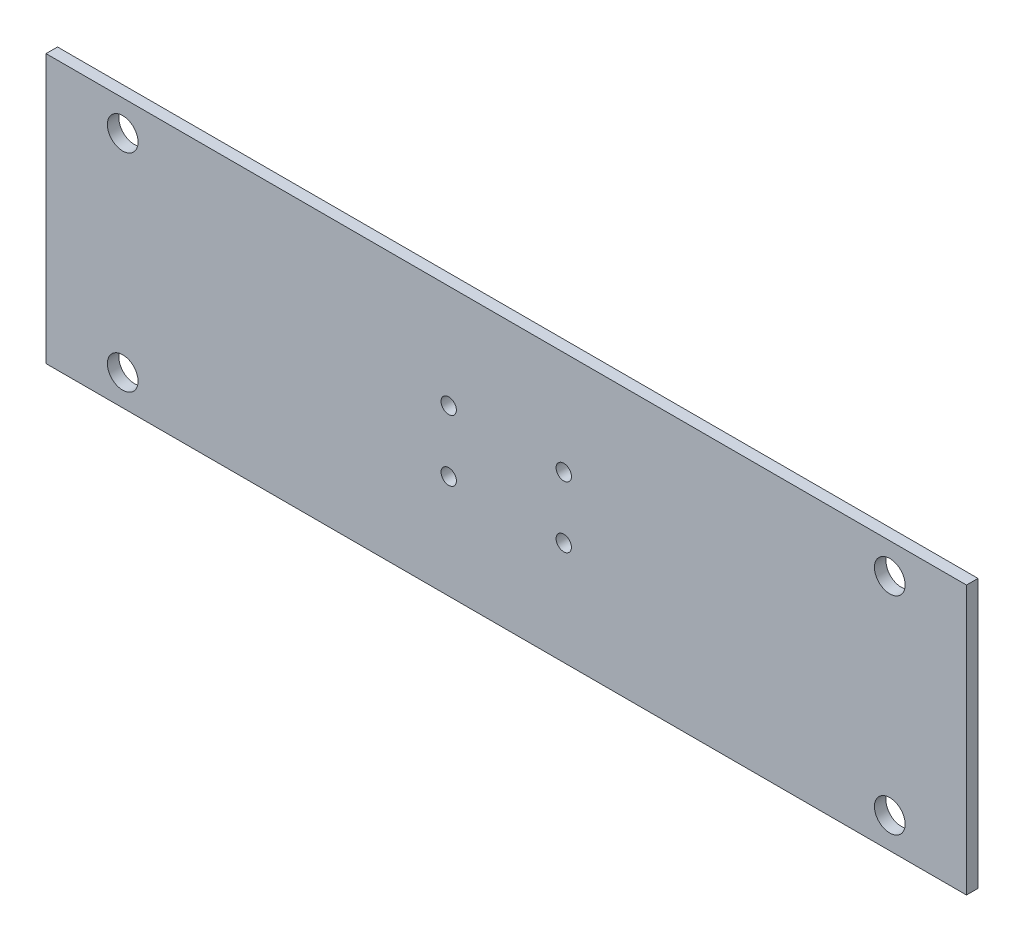
ISO-10303-21;
HEADER;
FILE_DESCRIPTION(('STEP AP214'),'2;1');
FILE_NAME('part.step','',(''),(''),'','','');
FILE_SCHEMA(('AUTOMOTIVE_DESIGN { 1 0 10303 214 1 1 1 1 }'));
ENDSEC;
DATA;
#1=APPLICATION_CONTEXT('core data for automotive mechanical design processes');
#2=APPLICATION_PROTOCOL_DEFINITION('international standard','automotive_design',2000,#1);
#3=PRODUCT_CONTEXT('',#1,'mechanical');
#4=PRODUCT('Part','Part','',(#3));
#5=PRODUCT_RELATED_PRODUCT_CATEGORY('part','',(#4));
#6=PRODUCT_DEFINITION_FORMATION('','',#4);
#7=PRODUCT_DEFINITION_CONTEXT('part definition',#1,'design');
#8=PRODUCT_DEFINITION('design','',#6,#7);
#9=PRODUCT_DEFINITION_SHAPE('','',#8);
#10=(LENGTH_UNIT() NAMED_UNIT(*) SI_UNIT(.MILLI.,.METRE.));
#11=(NAMED_UNIT(*) PLANE_ANGLE_UNIT() SI_UNIT($,.RADIAN.));
#12=(NAMED_UNIT(*) SI_UNIT($,.STERADIAN.) SOLID_ANGLE_UNIT());
#13=UNCERTAINTY_MEASURE_WITH_UNIT(LENGTH_MEASURE(1.E-05),#10,'distance_accuracy_value','');
#14=(GEOMETRIC_REPRESENTATION_CONTEXT(3) GLOBAL_UNCERTAINTY_ASSIGNED_CONTEXT((#13)) GLOBAL_UNIT_ASSIGNED_CONTEXT((#10,
#11,#12)) REPRESENTATION_CONTEXT('',''));
#15=CARTESIAN_POINT('',(0.,0.,0.));
#16=DIRECTION('',(0.,0.,1.));
#17=DIRECTION('',(1.,0.,0.));
#18=AXIS2_PLACEMENT_3D('',#15,#16,#17);
#19=CARTESIAN_POINT('',(0.,0.,3.));
#20=DIRECTION('',(0.,0.,-1.));
#21=DIRECTION('',(-1.,0.,0.));
#22=AXIS2_PLACEMENT_3D('',#19,#20,#21);
#23=PLANE('',#22);
#24=DIRECTION('',(0.,1.,0.));
#25=VECTOR('',#24,1.);
#26=CARTESIAN_POINT('',(120.,-35.,3.));
#27=LINE('',#26,#25);
#28=CARTESIAN_POINT('',(120.,-35.,3.));
#29=VERTEX_POINT('',#28);
#30=CARTESIAN_POINT('',(120.,35.,3.));
#31=VERTEX_POINT('',#30);
#32=EDGE_CURVE('E92',#29,#31,#27,.T.);
#33=ORIENTED_EDGE('',*,*,#32,.T.);
#34=DIRECTION('',(-1.,0.,0.));
#35=VECTOR('',#34,1.);
#36=CARTESIAN_POINT('',(-120.,35.,3.));
#37=LINE('',#36,#35);
#38=CARTESIAN_POINT('',(-120.,35.,3.));
#39=VERTEX_POINT('',#38);
#40=EDGE_CURVE('E87',#31,#39,#37,.T.);
#41=ORIENTED_EDGE('',*,*,#40,.T.);
#42=DIRECTION('',(0.,-1.,0.));
#43=VECTOR('',#42,1.);
#44=CARTESIAN_POINT('',(-120.,-35.,3.));
#45=LINE('',#44,#43);
#46=CARTESIAN_POINT('',(-120.,-35.,3.));
#47=VERTEX_POINT('',#46);
#48=EDGE_CURVE('E90',#39,#47,#45,.T.);
#49=ORIENTED_EDGE('',*,*,#48,.T.);
#50=DIRECTION('',(1.,0.,0.));
#51=VECTOR('',#50,1.);
#52=CARTESIAN_POINT('',(-120.,-35.,3.));
#53=LINE('',#52,#51);
#54=EDGE_CURVE('E57',#47,#29,#53,.T.);
#55=ORIENTED_EDGE('',*,*,#54,.T.);
#56=EDGE_LOOP('',(#33,#41,#49,#55));
#57=FACE_BOUND('',#56,.T.);
#58=CARTESIAN_POINT('',(-100.,27.,3.));
#59=DIRECTION('',(0.,0.,1.));
#60=DIRECTION('',(1.,0.,0.));
#61=AXIS2_PLACEMENT_3D('',#58,#59,#60);
#62=CIRCLE('',#61,4.00000000000001);
#63=CARTESIAN_POINT('',(-96.,27.,3.));
#64=VERTEX_POINT('',#63);
#65=EDGE_CURVE('E112',#64,#64,#62,.T.);
#66=ORIENTED_EDGE('',*,*,#65,.F.);
#67=EDGE_LOOP('',(#66));
#68=FACE_BOUND('',#67,.T.);
#69=CARTESIAN_POINT('',(99.9999999999999,27.,3.));
#70=DIRECTION('',(0.,0.,1.));
#71=DIRECTION('',(-1.,0.,0.));
#72=AXIS2_PLACEMENT_3D('',#69,#70,#71);
#73=CIRCLE('',#72,4.00000000000001);
#74=CARTESIAN_POINT('',(95.9999999999999,27.,3.));
#75=VERTEX_POINT('',#74);
#76=EDGE_CURVE('E134',#75,#75,#73,.T.);
#77=ORIENTED_EDGE('',*,*,#76,.F.);
#78=EDGE_LOOP('',(#77));
#79=FACE_BOUND('',#78,.T.);
#80=CARTESIAN_POINT('',(99.9999999999998,-27.,3.));
#81=DIRECTION('',(0.,0.,1.));
#82=DIRECTION('',(1.,0.,0.));
#83=AXIS2_PLACEMENT_3D('',#80,#81,#82);
#84=CIRCLE('',#83,4.00000000000001);
#85=CARTESIAN_POINT('',(104.,-27.,3.));
#86=VERTEX_POINT('',#85);
#87=EDGE_CURVE('E142',#86,#86,#84,.T.);
#88=ORIENTED_EDGE('',*,*,#87,.F.);
#89=EDGE_LOOP('',(#88));
#90=FACE_BOUND('',#89,.T.);
#91=CARTESIAN_POINT('',(-100.,-27.,3.));
#92=DIRECTION('',(0.,0.,1.));
#93=DIRECTION('',(-1.,0.,0.));
#94=AXIS2_PLACEMENT_3D('',#91,#92,#93);
#95=CIRCLE('',#94,4.00000000000001);
#96=CARTESIAN_POINT('',(-104.,-27.,3.));
#97=VERTEX_POINT('',#96);
#98=EDGE_CURVE('E150',#97,#97,#95,.T.);
#99=ORIENTED_EDGE('',*,*,#98,.F.);
#100=EDGE_LOOP('',(#99));
#101=FACE_BOUND('',#100,.T.);
#102=CARTESIAN_POINT('',(-15.,8.,3.));
#103=DIRECTION('',(0.,0.,1.));
#104=DIRECTION('',(1.,0.,0.));
#105=AXIS2_PLACEMENT_3D('',#102,#103,#104);
#106=CIRCLE('',#105,2.);
#107=CARTESIAN_POINT('',(-13.,8.,3.));
#108=VERTEX_POINT('',#107);
#109=EDGE_CURVE('E158',#108,#108,#106,.T.);
#110=ORIENTED_EDGE('',*,*,#109,.F.);
#111=EDGE_LOOP('',(#110));
#112=FACE_BOUND('',#111,.T.);
#113=CARTESIAN_POINT('',(15.,8.,3.));
#114=DIRECTION('',(0.,0.,1.));
#115=DIRECTION('',(-1.,0.,0.));
#116=AXIS2_PLACEMENT_3D('',#113,#114,#115);
#117=CIRCLE('',#116,2.);
#118=CARTESIAN_POINT('',(13.,8.,3.));
#119=VERTEX_POINT('',#118);
#120=EDGE_CURVE('E166',#119,#119,#117,.T.);
#121=ORIENTED_EDGE('',*,*,#120,.F.);
#122=EDGE_LOOP('',(#121));
#123=FACE_BOUND('',#122,.T.);
#124=CARTESIAN_POINT('',(14.9999999999999,-8.,3.));
#125=DIRECTION('',(0.,0.,1.));
#126=DIRECTION('',(1.,0.,0.));
#127=AXIS2_PLACEMENT_3D('',#124,#125,#126);
#128=CIRCLE('',#127,2.);
#129=CARTESIAN_POINT('',(16.9999999999999,-8.,3.));
#130=VERTEX_POINT('',#129);
#131=EDGE_CURVE('E174',#130,#130,#128,.T.);
#132=ORIENTED_EDGE('',*,*,#131,.F.);
#133=EDGE_LOOP('',(#132));
#134=FACE_BOUND('',#133,.T.);
#135=CARTESIAN_POINT('',(-15.0000000000001,-8.,3.));
#136=DIRECTION('',(0.,0.,1.));
#137=DIRECTION('',(-1.,0.,0.));
#138=AXIS2_PLACEMENT_3D('',#135,#136,#137);
#139=CIRCLE('',#138,2.);
#140=CARTESIAN_POINT('',(-17.0000000000001,-8.,3.));
#141=VERTEX_POINT('',#140);
#142=EDGE_CURVE('E182',#141,#141,#139,.T.);
#143=ORIENTED_EDGE('',*,*,#142,.F.);
#144=EDGE_LOOP('',(#143));
#145=FACE_BOUND('',#144,.T.);
#146=ADVANCED_FACE('F39',(#57,#68,#79,#90,#101,#112,#123,#134,#145),#23,.F.);
#147=CARTESIAN_POINT('',(0.,0.,0.));
#148=DIRECTION('',(0.,0.,-1.));
#149=DIRECTION('',(-1.,0.,0.));
#150=AXIS2_PLACEMENT_3D('',#147,#148,#149);
#151=PLANE('',#150);
#152=CARTESIAN_POINT('',(14.9999999999999,-8.,0.));
#153=DIRECTION('',(0.,0.,1.));
#154=DIRECTION('',(1.,0.,0.));
#155=AXIS2_PLACEMENT_3D('',#152,#153,#154);
#156=CIRCLE('',#155,2.);
#157=CARTESIAN_POINT('',(16.9999999999999,-8.,0.));
#158=VERTEX_POINT('',#157);
#159=EDGE_CURVE('E178',#158,#158,#156,.T.);
#160=ORIENTED_EDGE('',*,*,#159,.T.);
#161=EDGE_LOOP('',(#160));
#162=FACE_BOUND('',#161,.T.);
#163=CARTESIAN_POINT('',(-15.,8.,0.));
#164=DIRECTION('',(0.,0.,1.));
#165=DIRECTION('',(1.,0.,0.));
#166=AXIS2_PLACEMENT_3D('',#163,#164,#165);
#167=CIRCLE('',#166,2.);
#168=CARTESIAN_POINT('',(-13.,8.,0.));
#169=VERTEX_POINT('',#168);
#170=EDGE_CURVE('E162',#169,#169,#167,.T.);
#171=ORIENTED_EDGE('',*,*,#170,.T.);
#172=EDGE_LOOP('',(#171));
#173=FACE_BOUND('',#172,.T.);
#174=CARTESIAN_POINT('',(99.9999999999998,-27.,0.));
#175=DIRECTION('',(0.,0.,1.));
#176=DIRECTION('',(1.,0.,0.));
#177=AXIS2_PLACEMENT_3D('',#174,#175,#176);
#178=CIRCLE('',#177,4.00000000000001);
#179=CARTESIAN_POINT('',(104.,-27.,0.));
#180=VERTEX_POINT('',#179);
#181=EDGE_CURVE('E146',#180,#180,#178,.T.);
#182=ORIENTED_EDGE('',*,*,#181,.T.);
#183=EDGE_LOOP('',(#182));
#184=FACE_BOUND('',#183,.T.);
#185=CARTESIAN_POINT('',(-100.,27.,0.));
#186=DIRECTION('',(0.,0.,1.));
#187=DIRECTION('',(1.,0.,0.));
#188=AXIS2_PLACEMENT_3D('',#185,#186,#187);
#189=CIRCLE('',#188,4.00000000000001);
#190=CARTESIAN_POINT('',(-96.,27.,0.));
#191=VERTEX_POINT('',#190);
#192=EDGE_CURVE('E130',#191,#191,#189,.T.);
#193=ORIENTED_EDGE('',*,*,#192,.T.);
#194=EDGE_LOOP('',(#193));
#195=FACE_BOUND('',#194,.T.);
#196=DIRECTION('',(0.,1.,0.));
#197=VECTOR('',#196,1.);
#198=CARTESIAN_POINT('',(120.,-35.,0.));
#199=LINE('',#198,#197);
#200=CARTESIAN_POINT('',(120.,-35.,0.));
#201=VERTEX_POINT('',#200);
#202=CARTESIAN_POINT('',(120.,35.,0.));
#203=VERTEX_POINT('',#202);
#204=EDGE_CURVE('E108',#201,#203,#199,.T.);
#205=ORIENTED_EDGE('',*,*,#204,.F.);
#206=DIRECTION('',(1.,0.,0.));
#207=VECTOR('',#206,1.);
#208=CARTESIAN_POINT('',(-120.,-35.,0.));
#209=LINE('',#208,#207);
#210=CARTESIAN_POINT('',(-120.,-35.,0.));
#211=VERTEX_POINT('',#210);
#212=EDGE_CURVE('E80',#211,#201,#209,.T.);
#213=ORIENTED_EDGE('',*,*,#212,.F.);
#214=DIRECTION('',(0.,-1.,0.));
#215=VECTOR('',#214,1.);
#216=CARTESIAN_POINT('',(-120.,-35.,0.));
#217=LINE('',#216,#215);
#218=CARTESIAN_POINT('',(-120.,35.,0.));
#219=VERTEX_POINT('',#218);
#220=EDGE_CURVE('E74',#219,#211,#217,.T.);
#221=ORIENTED_EDGE('',*,*,#220,.F.);
#222=DIRECTION('',(-1.,0.,0.));
#223=VECTOR('',#222,1.);
#224=CARTESIAN_POINT('',(-120.,35.,0.));
#225=LINE('',#224,#223);
#226=EDGE_CURVE('E97',#203,#219,#225,.T.);
#227=ORIENTED_EDGE('',*,*,#226,.F.);
#228=EDGE_LOOP('',(#205,#213,#221,#227));
#229=FACE_BOUND('',#228,.T.);
#230=CARTESIAN_POINT('',(99.9999999999999,27.,0.));
#231=DIRECTION('',(0.,0.,1.));
#232=DIRECTION('',(-1.,0.,0.));
#233=AXIS2_PLACEMENT_3D('',#230,#231,#232);
#234=CIRCLE('',#233,4.00000000000001);
#235=CARTESIAN_POINT('',(95.9999999999999,27.,0.));
#236=VERTEX_POINT('',#235);
#237=EDGE_CURVE('E138',#236,#236,#234,.T.);
#238=ORIENTED_EDGE('',*,*,#237,.T.);
#239=EDGE_LOOP('',(#238));
#240=FACE_BOUND('',#239,.T.);
#241=CARTESIAN_POINT('',(-100.,-27.,0.));
#242=DIRECTION('',(0.,0.,1.));
#243=DIRECTION('',(-1.,0.,0.));
#244=AXIS2_PLACEMENT_3D('',#241,#242,#243);
#245=CIRCLE('',#244,4.00000000000001);
#246=CARTESIAN_POINT('',(-104.,-27.,0.));
#247=VERTEX_POINT('',#246);
#248=EDGE_CURVE('E154',#247,#247,#245,.T.);
#249=ORIENTED_EDGE('',*,*,#248,.T.);
#250=EDGE_LOOP('',(#249));
#251=FACE_BOUND('',#250,.T.);
#252=CARTESIAN_POINT('',(15.,8.,0.));
#253=DIRECTION('',(0.,0.,1.));
#254=DIRECTION('',(-1.,0.,0.));
#255=AXIS2_PLACEMENT_3D('',#252,#253,#254);
#256=CIRCLE('',#255,2.);
#257=CARTESIAN_POINT('',(13.,8.,0.));
#258=VERTEX_POINT('',#257);
#259=EDGE_CURVE('E170',#258,#258,#256,.T.);
#260=ORIENTED_EDGE('',*,*,#259,.T.);
#261=EDGE_LOOP('',(#260));
#262=FACE_BOUND('',#261,.T.);
#263=CARTESIAN_POINT('',(-15.0000000000001,-8.,0.));
#264=DIRECTION('',(0.,0.,1.));
#265=DIRECTION('',(-1.,0.,0.));
#266=AXIS2_PLACEMENT_3D('',#263,#264,#265);
#267=CIRCLE('',#266,2.);
#268=CARTESIAN_POINT('',(-17.0000000000001,-8.,0.));
#269=VERTEX_POINT('',#268);
#270=EDGE_CURVE('E186',#269,#269,#267,.T.);
#271=ORIENTED_EDGE('',*,*,#270,.T.);
#272=EDGE_LOOP('',(#271));
#273=FACE_BOUND('',#272,.T.);
#274=ADVANCED_FACE('F125',(#162,#173,#184,#195,#229,#240,#251,#262,#273),#151,.T.);
#275=CARTESIAN_POINT('',(120.,-35.,3.));
#276=DIRECTION('',(-1.,0.,0.));
#277=DIRECTION('',(0.,0.,1.));
#278=AXIS2_PLACEMENT_3D('',#275,#276,#277);
#279=PLANE('',#278);
#280=ORIENTED_EDGE('',*,*,#204,.T.);
#281=DIRECTION('',(0.,0.,-1.));
#282=VECTOR('',#281,1.);
#283=CARTESIAN_POINT('',(120.,35.,3.));
#284=LINE('',#283,#282);
#285=EDGE_CURVE('E11',#31,#203,#284,.T.);
#286=ORIENTED_EDGE('',*,*,#285,.F.);
#287=ORIENTED_EDGE('',*,*,#32,.F.);
#288=DIRECTION('',(0.,0.,-1.));
#289=VECTOR('',#288,1.);
#290=CARTESIAN_POINT('',(120.,-35.,3.));
#291=LINE('',#290,#289);
#292=EDGE_CURVE('E104',#29,#201,#291,.T.);
#293=ORIENTED_EDGE('',*,*,#292,.T.);
#294=EDGE_LOOP('',(#280,#286,#287,#293));
#295=FACE_BOUND('',#294,.T.);
#296=ADVANCED_FACE('F41',(#295),#279,.F.);
#297=CARTESIAN_POINT('',(-120.,35.,3.));
#298=DIRECTION('',(0.,-1.,0.));
#299=DIRECTION('',(0.,0.,-1.));
#300=AXIS2_PLACEMENT_3D('',#297,#298,#299);
#301=PLANE('',#300);
#302=ORIENTED_EDGE('',*,*,#226,.T.);
#303=DIRECTION('',(0.,0.,-1.));
#304=VECTOR('',#303,1.);
#305=CARTESIAN_POINT('',(-120.,35.,3.));
#306=LINE('',#305,#304);
#307=EDGE_CURVE('E49',#39,#219,#306,.T.);
#308=ORIENTED_EDGE('',*,*,#307,.F.);
#309=ORIENTED_EDGE('',*,*,#40,.F.);
#310=ORIENTED_EDGE('',*,*,#285,.T.);
#311=EDGE_LOOP('',(#302,#308,#309,#310));
#312=FACE_BOUND('',#311,.T.);
#313=ADVANCED_FACE('F96',(#312),#301,.F.);
#314=CARTESIAN_POINT('',(-120.,-35.,3.));
#315=DIRECTION('',(1.,0.,0.));
#316=DIRECTION('',(0.,0.,-1.));
#317=AXIS2_PLACEMENT_3D('',#314,#315,#316);
#318=PLANE('',#317);
#319=ORIENTED_EDGE('',*,*,#220,.T.);
#320=DIRECTION('',(0.,0.,-1.));
#321=VECTOR('',#320,1.);
#322=CARTESIAN_POINT('',(-120.,-35.,3.));
#323=LINE('',#322,#321);
#324=EDGE_CURVE('E99',#47,#211,#323,.T.);
#325=ORIENTED_EDGE('',*,*,#324,.F.);
#326=ORIENTED_EDGE('',*,*,#48,.F.);
#327=ORIENTED_EDGE('',*,*,#307,.T.);
#328=EDGE_LOOP('',(#319,#325,#326,#327));
#329=FACE_BOUND('',#328,.T.);
#330=ADVANCED_FACE('F100',(#329),#318,.F.);
#331=CARTESIAN_POINT('',(-120.,-35.,3.));
#332=DIRECTION('',(0.,1.,0.));
#333=DIRECTION('',(0.,0.,1.));
#334=AXIS2_PLACEMENT_3D('',#331,#332,#333);
#335=PLANE('',#334);
#336=ORIENTED_EDGE('',*,*,#212,.T.);
#337=ORIENTED_EDGE('',*,*,#292,.F.);
#338=ORIENTED_EDGE('',*,*,#54,.F.);
#339=ORIENTED_EDGE('',*,*,#324,.T.);
#340=EDGE_LOOP('',(#336,#337,#338,#339));
#341=FACE_BOUND('',#340,.T.);
#342=ADVANCED_FACE('F122',(#341),#335,.F.);
#343=CARTESIAN_POINT('',(-100.,27.,3.));
#344=DIRECTION('',(0.,0.,-1.));
#345=DIRECTION('',(-1.,0.,0.));
#346=AXIS2_PLACEMENT_3D('',#343,#344,#345);
#347=CYLINDRICAL_SURFACE('',#346,4.00000000000001);
#348=ORIENTED_EDGE('',*,*,#65,.T.);
#349=EDGE_LOOP('',(#348));
#350=FACE_BOUND('',#349,.T.);
#351=ORIENTED_EDGE('',*,*,#192,.F.);
#352=EDGE_LOOP('',(#351));
#353=FACE_BOUND('',#352,.T.);
#354=ADVANCED_FACE('F205',(#350,#353),#347,.F.);
#355=CARTESIAN_POINT('',(99.9999999999999,27.,3.));
#356=DIRECTION('',(0.,0.,-1.));
#357=DIRECTION('',(-1.,0.,0.));
#358=AXIS2_PLACEMENT_3D('',#355,#356,#357);
#359=CYLINDRICAL_SURFACE('',#358,4.00000000000001);
#360=ORIENTED_EDGE('',*,*,#76,.T.);
#361=EDGE_LOOP('',(#360));
#362=FACE_BOUND('',#361,.T.);
#363=ORIENTED_EDGE('',*,*,#237,.F.);
#364=EDGE_LOOP('',(#363));
#365=FACE_BOUND('',#364,.T.);
#366=ADVANCED_FACE('F251',(#362,#365),#359,.F.);
#367=CARTESIAN_POINT('',(99.9999999999998,-27.,3.));
#368=DIRECTION('',(0.,0.,-1.));
#369=DIRECTION('',(-1.,0.,0.));
#370=AXIS2_PLACEMENT_3D('',#367,#368,#369);
#371=CYLINDRICAL_SURFACE('',#370,4.00000000000001);
#372=ORIENTED_EDGE('',*,*,#87,.T.);
#373=EDGE_LOOP('',(#372));
#374=FACE_BOUND('',#373,.T.);
#375=ORIENTED_EDGE('',*,*,#181,.F.);
#376=EDGE_LOOP('',(#375));
#377=FACE_BOUND('',#376,.T.);
#378=ADVANCED_FACE('F259',(#374,#377),#371,.F.);
#379=CARTESIAN_POINT('',(-100.,-27.,3.));
#380=DIRECTION('',(0.,0.,-1.));
#381=DIRECTION('',(-1.,0.,0.));
#382=AXIS2_PLACEMENT_3D('',#379,#380,#381);
#383=CYLINDRICAL_SURFACE('',#382,4.00000000000001);
#384=ORIENTED_EDGE('',*,*,#98,.T.);
#385=EDGE_LOOP('',(#384));
#386=FACE_BOUND('',#385,.T.);
#387=ORIENTED_EDGE('',*,*,#248,.F.);
#388=EDGE_LOOP('',(#387));
#389=FACE_BOUND('',#388,.T.);
#390=ADVANCED_FACE('F267',(#386,#389),#383,.F.);
#391=CARTESIAN_POINT('',(-15.,8.,3.));
#392=DIRECTION('',(0.,0.,-1.));
#393=DIRECTION('',(-1.,0.,0.));
#394=AXIS2_PLACEMENT_3D('',#391,#392,#393);
#395=CYLINDRICAL_SURFACE('',#394,2.);
#396=ORIENTED_EDGE('',*,*,#109,.T.);
#397=EDGE_LOOP('',(#396));
#398=FACE_BOUND('',#397,.T.);
#399=ORIENTED_EDGE('',*,*,#170,.F.);
#400=EDGE_LOOP('',(#399));
#401=FACE_BOUND('',#400,.T.);
#402=ADVANCED_FACE('F276',(#398,#401),#395,.F.);
#403=CARTESIAN_POINT('',(15.,8.,3.));
#404=DIRECTION('',(0.,0.,-1.));
#405=DIRECTION('',(-1.,0.,0.));
#406=AXIS2_PLACEMENT_3D('',#403,#404,#405);
#407=CYLINDRICAL_SURFACE('',#406,2.);
#408=ORIENTED_EDGE('',*,*,#120,.T.);
#409=EDGE_LOOP('',(#408));
#410=FACE_BOUND('',#409,.T.);
#411=ORIENTED_EDGE('',*,*,#259,.F.);
#412=EDGE_LOOP('',(#411));
#413=FACE_BOUND('',#412,.T.);
#414=ADVANCED_FACE('F285',(#410,#413),#407,.F.);
#415=CARTESIAN_POINT('',(14.9999999999999,-8.,3.));
#416=DIRECTION('',(0.,0.,-1.));
#417=DIRECTION('',(-1.,0.,0.));
#418=AXIS2_PLACEMENT_3D('',#415,#416,#417);
#419=CYLINDRICAL_SURFACE('',#418,2.);
#420=ORIENTED_EDGE('',*,*,#131,.T.);
#421=EDGE_LOOP('',(#420));
#422=FACE_BOUND('',#421,.T.);
#423=ORIENTED_EDGE('',*,*,#159,.F.);
#424=EDGE_LOOP('',(#423));
#425=FACE_BOUND('',#424,.T.);
#426=ADVANCED_FACE('F294',(#422,#425),#419,.F.);
#427=CARTESIAN_POINT('',(-15.0000000000001,-8.,3.));
#428=DIRECTION('',(0.,0.,-1.));
#429=DIRECTION('',(-1.,0.,0.));
#430=AXIS2_PLACEMENT_3D('',#427,#428,#429);
#431=CYLINDRICAL_SURFACE('',#430,2.);
#432=ORIENTED_EDGE('',*,*,#142,.T.);
#433=EDGE_LOOP('',(#432));
#434=FACE_BOUND('',#433,.T.);
#435=ORIENTED_EDGE('',*,*,#270,.F.);
#436=EDGE_LOOP('',(#435));
#437=FACE_BOUND('',#436,.T.);
#438=ADVANCED_FACE('F194',(#434,#437),#431,.F.);
#439=CLOSED_SHELL('',(#146,#274,#296,#313,#330,#342,#354,#366,#378,#390,#402,#414,#426,#438));
#440=MANIFOLD_SOLID_BREP('B2',#439);
#441=ADVANCED_BREP_SHAPE_REPRESENTATION('',(#18,#440),#14);
#442=SHAPE_DEFINITION_REPRESENTATION(#9,#441);
ENDSEC;
END-ISO-10303-21;
